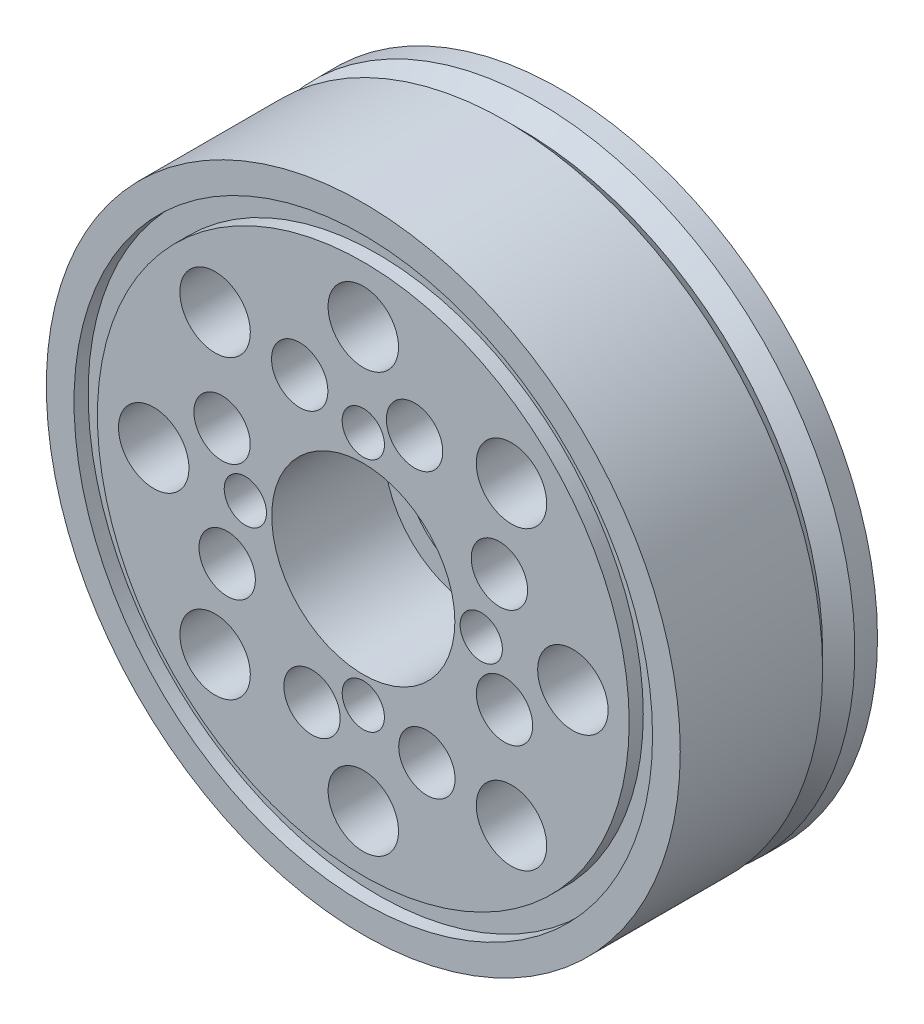
ISO-10303-21;
HEADER;
FILE_DESCRIPTION(('STEP AP214'),'2;1');
FILE_NAME('part.step','',(''),(''),'','','');
FILE_SCHEMA(('AUTOMOTIVE_DESIGN { 1 0 10303 214 1 1 1 1 }'));
ENDSEC;
DATA;
#1=APPLICATION_CONTEXT('core data for automotive mechanical design processes');
#2=APPLICATION_PROTOCOL_DEFINITION('international standard','automotive_design',2000,#1);
#3=PRODUCT_CONTEXT('',#1,'mechanical');
#4=PRODUCT('Part','Part','',(#3));
#5=PRODUCT_RELATED_PRODUCT_CATEGORY('part','',(#4));
#6=PRODUCT_DEFINITION_FORMATION('','',#4);
#7=PRODUCT_DEFINITION_CONTEXT('part definition',#1,'design');
#8=PRODUCT_DEFINITION('design','',#6,#7);
#9=PRODUCT_DEFINITION_SHAPE('','',#8);
#10=(LENGTH_UNIT() NAMED_UNIT(*) SI_UNIT(.MILLI.,.METRE.));
#11=(NAMED_UNIT(*) PLANE_ANGLE_UNIT() SI_UNIT($,.RADIAN.));
#12=(NAMED_UNIT(*) SI_UNIT($,.STERADIAN.) SOLID_ANGLE_UNIT());
#13=UNCERTAINTY_MEASURE_WITH_UNIT(LENGTH_MEASURE(1.E-05),#10,'distance_accuracy_value','');
#14=(GEOMETRIC_REPRESENTATION_CONTEXT(3) GLOBAL_UNCERTAINTY_ASSIGNED_CONTEXT((#13)) GLOBAL_UNIT_ASSIGNED_CONTEXT((#10,
#11,#12)) REPRESENTATION_CONTEXT('',''));
#15=CARTESIAN_POINT('',(0.,0.,0.));
#16=DIRECTION('',(0.,0.,1.));
#17=DIRECTION('',(1.,0.,0.));
#18=AXIS2_PLACEMENT_3D('',#15,#16,#17);
#19=CARTESIAN_POINT('',(0.,0.,15.827184369982));
#20=DIRECTION('',(0.,0.,-1.));
#21=DIRECTION('',(-1.,0.,0.));
#22=AXIS2_PLACEMENT_3D('',#19,#20,#21);
#23=CYLINDRICAL_SURFACE('',#22,27.999999);
#24=CARTESIAN_POINT('',(0.,0.,-1.59503723001799));
#25=DIRECTION('',(0.,0.,1.));
#26=DIRECTION('',(1.,0.,0.));
#27=AXIS2_PLACEMENT_3D('',#24,#25,#26);
#28=CIRCLE('',#27,27.999999);
#29=CARTESIAN_POINT('',(27.999999,0.,-1.59503723001799));
#30=VERTEX_POINT('',#29);
#31=EDGE_CURVE('E40',#30,#30,#28,.T.);
#32=ORIENTED_EDGE('',*,*,#31,.T.);
#33=EDGE_LOOP('',(#32));
#34=FACE_BOUND('',#33,.T.);
#35=CARTESIAN_POINT('',(0.,0.,0.404962769982008));
#36=DIRECTION('',(0.,0.,-1.));
#37=DIRECTION('',(-1.,0.,0.));
#38=AXIS2_PLACEMENT_3D('',#35,#36,#37);
#39=CIRCLE('',#38,27.999999);
#40=CARTESIAN_POINT('',(-27.999999,0.,0.404962769982008));
#41=VERTEX_POINT('',#40);
#42=EDGE_CURVE('E36',#41,#41,#39,.F.);
#43=ORIENTED_EDGE('',*,*,#42,.F.);
#44=EDGE_LOOP('',(#43));
#45=FACE_BOUND('',#44,.T.);
#46=ADVANCED_FACE('F33',(#34,#45),#23,.T.);
#47=CARTESIAN_POINT('',(0.,0.,15.827184369982));
#48=DIRECTION('',(0.,0.,1.));
#49=DIRECTION('',(1.,0.,0.));
#50=AXIS2_PLACEMENT_3D('',#47,#48,#49);
#51=CIRCLE('',#50,27.999999);
#52=CARTESIAN_POINT('',(27.999999,0.,15.827184369982));
#53=VERTEX_POINT('',#52);
#54=EDGE_CURVE('E10',#53,#53,#51,.T.);
#55=ORIENTED_EDGE('',*,*,#54,.F.);
#56=EDGE_LOOP('',(#55));
#57=FACE_BOUND('',#56,.T.);
#58=CARTESIAN_POINT('',(0.,0.,3.25183966621644));
#59=DIRECTION('',(0.,0.,1.));
#60=DIRECTION('',(1.,0.,0.));
#61=AXIS2_PLACEMENT_3D('',#58,#59,#60);
#62=CIRCLE('',#61,27.999999);
#63=CARTESIAN_POINT('',(27.999999,0.,3.25183966621644));
#64=VERTEX_POINT('',#63);
#65=EDGE_CURVE('E50',#64,#64,#62,.F.);
#66=ORIENTED_EDGE('',*,*,#65,.F.);
#67=EDGE_LOOP('',(#66));
#68=FACE_BOUND('',#67,.T.);
#69=ADVANCED_FACE('F209',(#57,#68),#23,.T.);
#70=CARTESIAN_POINT('',(0.,0.,15.827184369982));
#71=DIRECTION('',(0.,0.,1.));
#72=DIRECTION('',(1.,0.,0.));
#73=AXIS2_PLACEMENT_3D('',#70,#71,#72);
#74=PLANE('',#73);
#75=CARTESIAN_POINT('',(0.,0.,15.827184369982));
#76=DIRECTION('',(0.,0.,1.));
#77=DIRECTION('',(1.,0.,0.));
#78=AXIS2_PLACEMENT_3D('',#75,#76,#77);
#79=CIRCLE('',#78,25.5528630080935);
#80=CARTESIAN_POINT('',(25.5528630080935,0.,15.827184369982));
#81=VERTEX_POINT('',#80);
#82=EDGE_CURVE('E48',#81,#81,#79,.T.);
#83=ORIENTED_EDGE('',*,*,#82,.F.);
#84=EDGE_LOOP('',(#83));
#85=FACE_BOUND('',#84,.T.);
#86=ORIENTED_EDGE('',*,*,#54,.T.);
#87=EDGE_LOOP('',(#86));
#88=FACE_BOUND('',#87,.T.);
#89=ADVANCED_FACE('F206',(#85,#88),#74,.T.);
#90=CARTESIAN_POINT('',(0.,0.,-1.59503723001799));
#91=DIRECTION('',(0.,0.,1.));
#92=DIRECTION('',(1.,0.,0.));
#93=AXIS2_PLACEMENT_3D('',#90,#91,#92);
#94=PLANE('',#93);
#95=CARTESIAN_POINT('',(0.,0.,-1.59503723001799));
#96=DIRECTION('',(0.,0.,1.));
#97=DIRECTION('',(1.,0.,0.));
#98=AXIS2_PLACEMENT_3D('',#95,#96,#97);
#99=CIRCLE('',#98,6.222222);
#100=CARTESIAN_POINT('',(6.222222,0.,-1.59503723001799));
#101=VERTEX_POINT('',#100);
#102=EDGE_CURVE('E184',#101,#101,#99,.T.);
#103=ORIENTED_EDGE('',*,*,#102,.T.);
#104=EDGE_LOOP('',(#103));
#105=FACE_BOUND('',#104,.T.);
#106=ORIENTED_EDGE('',*,*,#31,.F.);
#107=EDGE_LOOP('',(#106));
#108=FACE_BOUND('',#107,.T.);
#109=ADVANCED_FACE('F208',(#105,#108),#94,.F.);
#110=CARTESIAN_POINT('',(0.,0.,14.582739969982));
#111=DIRECTION('',(0.,0.,1.));
#112=DIRECTION('',(1.,0.,0.));
#113=AXIS2_PLACEMENT_3D('',#110,#111,#112);
#114=CYLINDRICAL_SURFACE('',#113,25.5528630080935);
#115=CARTESIAN_POINT('',(0.,0.,14.582739969982));
#116=DIRECTION('',(0.,0.,1.));
#117=DIRECTION('',(1.,0.,0.));
#118=AXIS2_PLACEMENT_3D('',#115,#116,#117);
#119=CIRCLE('',#118,25.5528630080935);
#120=CARTESIAN_POINT('',(25.5528630080935,0.,14.582739969982));
#121=VERTEX_POINT('',#120);
#122=EDGE_CURVE('E45',#121,#121,#119,.T.);
#123=ORIENTED_EDGE('',*,*,#122,.F.);
#124=EDGE_LOOP('',(#123));
#125=FACE_BOUND('',#124,.T.);
#126=ORIENTED_EDGE('',*,*,#82,.T.);
#127=EDGE_LOOP('',(#126));
#128=FACE_BOUND('',#127,.T.);
#129=ADVANCED_FACE('F204',(#125,#128),#114,.F.);
#130=CARTESIAN_POINT('',(0.,0.,14.582739969982));
#131=DIRECTION('',(0.,0.,1.));
#132=DIRECTION('',(1.,0.,0.));
#133=AXIS2_PLACEMENT_3D('',#130,#131,#132);
#134=PLANE('',#133);
#135=CARTESIAN_POINT('',(0.,0.,14.582739969982));
#136=DIRECTION('',(0.,0.,1.));
#137=DIRECTION('',(1.,0.,0.));
#138=AXIS2_PLACEMENT_3D('',#135,#136,#137);
#139=CIRCLE('',#138,23.48741959096);
#140=CARTESIAN_POINT('',(23.48741959096,0.,14.582739969982));
#141=VERTEX_POINT('',#140);
#142=EDGE_CURVE('E194',#141,#141,#139,.T.);
#143=ORIENTED_EDGE('',*,*,#142,.F.);
#144=EDGE_LOOP('',(#143));
#145=FACE_BOUND('',#144,.T.);
#146=ORIENTED_EDGE('',*,*,#122,.T.);
#147=EDGE_LOOP('',(#146));
#148=FACE_BOUND('',#147,.T.);
#149=ADVANCED_FACE('F414',(#145,#148),#134,.T.);
#150=CARTESIAN_POINT('',(0.,0.,14.582739969982));
#151=DIRECTION('',(0.,0.,1.));
#152=DIRECTION('',(1.,0.,0.));
#153=AXIS2_PLACEMENT_3D('',#150,#151,#152);
#154=CYLINDRICAL_SURFACE('',#153,23.48741959096);
#155=ORIENTED_EDGE('',*,*,#142,.T.);
#156=EDGE_LOOP('',(#155));
#157=FACE_BOUND('',#156,.T.);
#158=CARTESIAN_POINT('',(0.,0.,15.827184369982));
#159=DIRECTION('',(0.,0.,1.));
#160=DIRECTION('',(1.,0.,0.));
#161=AXIS2_PLACEMENT_3D('',#158,#159,#160);
#162=CIRCLE('',#161,23.48741959096);
#163=CARTESIAN_POINT('',(23.48741959096,0.,15.827184369982));
#164=VERTEX_POINT('',#163);
#165=EDGE_CURVE('E191',#164,#164,#162,.T.);
#166=ORIENTED_EDGE('',*,*,#165,.F.);
#167=EDGE_LOOP('',(#166));
#168=FACE_BOUND('',#167,.T.);
#169=ADVANCED_FACE('F221',(#157,#168),#154,.T.);
#170=CARTESIAN_POINT('',(-12.4737591529476,4.53005844783731,15.827184369982));
#171=DIRECTION('',(0.,0.,1.));
#172=DIRECTION('',(0.707106781186556,0.707106781186539,0.));
#173=AXIS2_PLACEMENT_3D('',#170,#171,#172);
#174=CIRCLE('',#173,2.4888888);
#175=CARTESIAN_POINT('',(-10.7138490048483,6.28996859593654,15.827184369982));
#176=VERTEX_POINT('',#175);
#177=EDGE_CURVE('E56',#176,#176,#174,.T.);
#178=ORIENTED_EDGE('',*,*,#177,.F.);
#179=EDGE_LOOP('',(#178));
#180=FACE_BOUND('',#179,.T.);
#181=CARTESIAN_POINT('',(-12.0235147315742,-5.61704463629988,15.827184369982));
#182=DIRECTION('',(0.,0.,1.));
#183=DIRECTION('',(0.,1.,0.));
#184=AXIS2_PLACEMENT_3D('',#181,#182,#183);
#185=CIRCLE('',#184,2.4888888);
#186=CARTESIAN_POINT('',(-12.0235147315742,-3.12815583629987,15.827184369982));
#187=VERTEX_POINT('',#186);
#188=EDGE_CURVE('E67',#187,#187,#185,.T.);
#189=ORIENTED_EDGE('',*,*,#188,.F.);
#190=EDGE_LOOP('',(#189));
#191=FACE_BOUND('',#190,.T.);
#192=CARTESIAN_POINT('',(-4.53005844783726,-12.4737591529476,15.827184369982));
#193=DIRECTION('',(0.,0.,1.));
#194=DIRECTION('',(-0.707106781186541,0.707106781186554,0.));
#195=AXIS2_PLACEMENT_3D('',#192,#193,#194);
#196=CIRCLE('',#195,2.4888888);
#197=CARTESIAN_POINT('',(-6.2899685959365,-10.7138490048484,15.827184369982));
#198=VERTEX_POINT('',#197);
#199=EDGE_CURVE('E73',#198,#198,#196,.T.);
#200=ORIENTED_EDGE('',*,*,#199,.F.);
#201=EDGE_LOOP('',(#200));
#202=FACE_BOUND('',#201,.T.);
#203=CARTESIAN_POINT('',(5.6170446363,-12.0235147315741,15.827184369982));
#204=DIRECTION('',(0.,0.,1.));
#205=DIRECTION('',(-1.,0.,0.));
#206=AXIS2_PLACEMENT_3D('',#203,#204,#205);
#207=CIRCLE('',#206,2.4888888);
#208=CARTESIAN_POINT('',(3.1281558363,-12.0235147315741,15.827184369982));
#209=VERTEX_POINT('',#208);
#210=EDGE_CURVE('E79',#209,#209,#207,.T.);
#211=ORIENTED_EDGE('',*,*,#210,.F.);
#212=EDGE_LOOP('',(#211));
#213=FACE_BOUND('',#212,.T.);
#214=CARTESIAN_POINT('',(12.4737591529476,-4.53005844783722,15.827184369982));
#215=DIRECTION('',(0.,0.,1.));
#216=DIRECTION('',(-0.707106781186551,-0.707106781186544,0.));
#217=AXIS2_PLACEMENT_3D('',#214,#215,#216);
#218=CIRCLE('',#217,2.4888888);
#219=CARTESIAN_POINT('',(10.7138490048484,-6.28996859593646,15.827184369982));
#220=VERTEX_POINT('',#219);
#221=EDGE_CURVE('E85',#220,#220,#218,.T.);
#222=ORIENTED_EDGE('',*,*,#221,.F.);
#223=EDGE_LOOP('',(#222));
#224=FACE_BOUND('',#223,.T.);
#225=CARTESIAN_POINT('',(12.0235147315741,5.61704463629996,15.827184369982));
#226=DIRECTION('',(0.,0.,1.));
#227=DIRECTION('',(0.,-1.,0.));
#228=AXIS2_PLACEMENT_3D('',#225,#226,#227);
#229=CIRCLE('',#228,2.4888888);
#230=CARTESIAN_POINT('',(12.0235147315741,3.12815583629996,15.827184369982));
#231=VERTEX_POINT('',#230);
#232=EDGE_CURVE('E91',#231,#231,#229,.T.);
#233=ORIENTED_EDGE('',*,*,#232,.F.);
#234=EDGE_LOOP('',(#233));
#235=FACE_BOUND('',#234,.T.);
#236=CARTESIAN_POINT('',(4.53005844783718,12.4737591529477,15.827184369982));
#237=DIRECTION('',(0.,0.,1.));
#238=DIRECTION('',(0.707106781186546,-0.707106781186549,0.));
#239=AXIS2_PLACEMENT_3D('',#236,#237,#238);
#240=CIRCLE('',#239,2.4888888);
#241=CARTESIAN_POINT('',(6.28996859593642,10.7138490048484,15.827184369982));
#242=VERTEX_POINT('',#241);
#243=EDGE_CURVE('E97',#242,#242,#240,.T.);
#244=ORIENTED_EDGE('',*,*,#243,.F.);
#245=EDGE_LOOP('',(#244));
#246=FACE_BOUND('',#245,.T.);
#247=CARTESIAN_POINT('',(-5.6170446363,12.0235147315741,15.827184369982));
#248=DIRECTION('',(0.,0.,1.));
#249=DIRECTION('',(1.,0.,0.));
#250=AXIS2_PLACEMENT_3D('',#247,#248,#249);
#251=CIRCLE('',#250,2.4888888);
#252=CARTESIAN_POINT('',(-3.1281558363,12.0235147315741,15.827184369982));
#253=VERTEX_POINT('',#252);
#254=EDGE_CURVE('E103',#253,#253,#251,.T.);
#255=ORIENTED_EDGE('',*,*,#254,.F.);
#256=EDGE_LOOP('',(#255));
#257=FACE_BOUND('',#256,.T.);
#258=CARTESIAN_POINT('',(-13.0906483291239,13.0906483291242,15.827184369982));
#259=DIRECTION('',(0.,0.,1.));
#260=DIRECTION('',(0.707106781186556,0.707106781186539,0.));
#261=AXIS2_PLACEMENT_3D('',#258,#259,#260);
#262=CIRCLE('',#261,3.111111);
#263=CARTESIAN_POINT('',(-10.8907606439998,15.2905360142482,15.827184369982));
#264=VERTEX_POINT('',#263);
#265=EDGE_CURVE('E107',#264,#264,#262,.T.);
#266=ORIENTED_EDGE('',*,*,#265,.F.);
#267=EDGE_LOOP('',(#266));
#268=FACE_BOUND('',#267,.T.);
#269=CARTESIAN_POINT('',(-18.5129724073039,1.94376956044558E-13,15.827184369982));
#270=DIRECTION('',(0.,0.,1.));
#271=DIRECTION('',(0.,1.,0.));
#272=AXIS2_PLACEMENT_3D('',#269,#270,#271);
#273=CIRCLE('',#272,3.111111);
#274=CARTESIAN_POINT('',(-18.5129724073039,3.11111100000019,15.827184369982));
#275=VERTEX_POINT('',#274);
#276=EDGE_CURVE('E115',#275,#275,#273,.T.);
#277=ORIENTED_EDGE('',*,*,#276,.F.);
#278=EDGE_LOOP('',(#277));
#279=FACE_BOUND('',#278,.T.);
#280=CARTESIAN_POINT('',(-13.0906483291241,-13.0906483291239,15.827184369982));
#281=DIRECTION('',(0.,0.,1.));
#282=DIRECTION('',(-0.707106781186541,0.707106781186554,0.));
#283=AXIS2_PLACEMENT_3D('',#280,#281,#282);
#284=CIRCLE('',#283,3.111111);
#285=CARTESIAN_POINT('',(-15.2905360142482,-10.8907606439998,15.827184369982));
#286=VERTEX_POINT('',#285);
#287=EDGE_CURVE('E121',#286,#286,#284,.T.);
#288=ORIENTED_EDGE('',*,*,#287,.F.);
#289=EDGE_LOOP('',(#288));
#290=FACE_BOUND('',#289,.T.);
#291=CARTESIAN_POINT('',(0.,-18.5129724073039,15.827184369982));
#292=DIRECTION('',(0.,0.,1.));
#293=DIRECTION('',(-1.,0.,0.));
#294=AXIS2_PLACEMENT_3D('',#291,#292,#293);
#295=CIRCLE('',#294,3.111111);
#296=CARTESIAN_POINT('',(-3.111111,-18.5129724073039,15.827184369982));
#297=VERTEX_POINT('',#296);
#298=EDGE_CURVE('E127',#297,#297,#295,.T.);
#299=ORIENTED_EDGE('',*,*,#298,.F.);
#300=EDGE_LOOP('',(#299));
#301=FACE_BOUND('',#300,.T.);
#302=CARTESIAN_POINT('',(13.090648329124,-13.0906483291241,15.827184369982));
#303=DIRECTION('',(0.,0.,1.));
#304=DIRECTION('',(-0.707106781186551,-0.707106781186544,0.));
#305=AXIS2_PLACEMENT_3D('',#302,#303,#304);
#306=CIRCLE('',#305,3.111111);
#307=CARTESIAN_POINT('',(10.8907606439999,-15.2905360142481,15.827184369982));
#308=VERTEX_POINT('',#307);
#309=EDGE_CURVE('E133',#308,#308,#306,.T.);
#310=ORIENTED_EDGE('',*,*,#309,.F.);
#311=EDGE_LOOP('',(#310));
#312=FACE_BOUND('',#311,.T.);
#313=CARTESIAN_POINT('',(18.5129724073039,0.,15.827184369982));
#314=DIRECTION('',(0.,0.,1.));
#315=DIRECTION('',(0.,-1.,0.));
#316=AXIS2_PLACEMENT_3D('',#313,#314,#315);
#317=CIRCLE('',#316,3.111111);
#318=CARTESIAN_POINT('',(18.5129724073039,-3.11111100000006,15.827184369982));
#319=VERTEX_POINT('',#318);
#320=EDGE_CURVE('E139',#319,#319,#317,.T.);
#321=ORIENTED_EDGE('',*,*,#320,.F.);
#322=EDGE_LOOP('',(#321));
#323=FACE_BOUND('',#322,.T.);
#324=CARTESIAN_POINT('',(13.090648329124,13.090648329124,15.827184369982));
#325=DIRECTION('',(0.,0.,1.));
#326=DIRECTION('',(0.707106781186546,-0.707106781186549,0.));
#327=AXIS2_PLACEMENT_3D('',#324,#325,#326);
#328=CIRCLE('',#327,3.111111);
#329=CARTESIAN_POINT('',(15.2905360142481,10.8907606439999,15.827184369982));
#330=VERTEX_POINT('',#329);
#331=EDGE_CURVE('E145',#330,#330,#328,.T.);
#332=ORIENTED_EDGE('',*,*,#331,.F.);
#333=EDGE_LOOP('',(#332));
#334=FACE_BOUND('',#333,.T.);
#335=CARTESIAN_POINT('',(0.,18.5129724073039,15.827184369982));
#336=DIRECTION('',(0.,0.,1.));
#337=DIRECTION('',(1.,0.,0.));
#338=AXIS2_PLACEMENT_3D('',#335,#336,#337);
#339=CIRCLE('',#338,3.111111);
#340=CARTESIAN_POINT('',(3.111111,18.5129724073039,15.827184369982));
#341=VERTEX_POINT('',#340);
#342=EDGE_CURVE('E151',#341,#341,#339,.T.);
#343=ORIENTED_EDGE('',*,*,#342,.F.);
#344=EDGE_LOOP('',(#343));
#345=FACE_BOUND('',#344,.T.);
#346=CARTESIAN_POINT('',(-10.4194886355998,1.09602213379154E-13,15.827184369982));
#347=DIRECTION('',(0.,0.,1.));
#348=DIRECTION('',(0.,1.,0.));
#349=AXIS2_PLACEMENT_3D('',#346,#347,#348);
#350=CIRCLE('',#349,1.8666666);
#351=CARTESIAN_POINT('',(-10.4194886355997,1.86666660000011,15.827184369982));
#352=VERTEX_POINT('',#351);
#353=EDGE_CURVE('E155',#352,#352,#350,.T.);
#354=ORIENTED_EDGE('',*,*,#353,.F.);
#355=EDGE_LOOP('',(#354));
#356=FACE_BOUND('',#355,.T.);
#357=CARTESIAN_POINT('',(0.,-10.4194886355998,15.827184369982));
#358=DIRECTION('',(0.,0.,1.));
#359=DIRECTION('',(-1.,0.,0.));
#360=AXIS2_PLACEMENT_3D('',#357,#358,#359);
#361=CIRCLE('',#360,1.8666666);
#362=CARTESIAN_POINT('',(-1.8666666,-10.4194886355998,15.827184369982));
#363=VERTEX_POINT('',#362);
#364=EDGE_CURVE('E163',#363,#363,#361,.T.);
#365=ORIENTED_EDGE('',*,*,#364,.F.);
#366=EDGE_LOOP('',(#365));
#367=FACE_BOUND('',#366,.T.);
#368=CARTESIAN_POINT('',(10.4194886355998,0.,15.827184369982));
#369=DIRECTION('',(0.,0.,1.));
#370=DIRECTION('',(0.,-1.,0.));
#371=AXIS2_PLACEMENT_3D('',#368,#369,#370);
#372=CIRCLE('',#371,1.8666666);
#373=CARTESIAN_POINT('',(10.4194886355997,-1.86666660000004,15.827184369982));
#374=VERTEX_POINT('',#373);
#375=EDGE_CURVE('E169',#374,#374,#372,.T.);
#376=ORIENTED_EDGE('',*,*,#375,.F.);
#377=EDGE_LOOP('',(#376));
#378=FACE_BOUND('',#377,.T.);
#379=CARTESIAN_POINT('',(0.,10.4194886355998,15.827184369982));
#380=DIRECTION('',(0.,0.,1.));
#381=DIRECTION('',(1.,0.,0.));
#382=AXIS2_PLACEMENT_3D('',#379,#380,#381);
#383=CIRCLE('',#382,1.8666666);
#384=CARTESIAN_POINT('',(1.8666666,10.4194886355998,15.827184369982));
#385=VERTEX_POINT('',#384);
#386=EDGE_CURVE('E175',#385,#385,#383,.T.);
#387=ORIENTED_EDGE('',*,*,#386,.F.);
#388=EDGE_LOOP('',(#387));
#389=FACE_BOUND('',#388,.T.);
#390=CARTESIAN_POINT('',(0.,0.,15.827184369982));
#391=DIRECTION('',(0.,0.,1.));
#392=DIRECTION('',(1.,0.,0.));
#393=AXIS2_PLACEMENT_3D('',#390,#391,#392);
#394=CIRCLE('',#393,8.0888886);
#395=CARTESIAN_POINT('',(8.0888886,0.,15.827184369982));
#396=VERTEX_POINT('',#395);
#397=EDGE_CURVE('E187',#396,#396,#394,.T.);
#398=ORIENTED_EDGE('',*,*,#397,.F.);
#399=EDGE_LOOP('',(#398));
#400=FACE_BOUND('',#399,.T.);
#401=ORIENTED_EDGE('',*,*,#165,.T.);
#402=EDGE_LOOP('',(#401));
#403=FACE_BOUND('',#402,.T.);
#404=ADVANCED_FACE('F211',(#180,#191,#202,#213,#224,#235,#246,#257,#268,#279,#290,#301,#312,
#323,#334,#345,#356,#367,#378,#389,#400,#403),#74,.T.);
#405=CARTESIAN_POINT('',(0.,0.,5.87162916998201));
#406=DIRECTION('',(0.,0.,1.));
#407=DIRECTION('',(1.,0.,0.));
#408=AXIS2_PLACEMENT_3D('',#405,#406,#407);
#409=CYLINDRICAL_SURFACE('',#408,8.0888886);
#410=CARTESIAN_POINT('',(0.,0.,5.87162916998201));
#411=DIRECTION('',(0.,0.,1.));
#412=DIRECTION('',(1.,0.,0.));
#413=AXIS2_PLACEMENT_3D('',#410,#411,#412);
#414=CIRCLE('',#413,8.0888886);
#415=CARTESIAN_POINT('',(8.0888886,0.,5.87162916998201));
#416=VERTEX_POINT('',#415);
#417=EDGE_CURVE('E188',#416,#416,#414,.T.);
#418=ORIENTED_EDGE('',*,*,#417,.F.);
#419=EDGE_LOOP('',(#418));
#420=FACE_BOUND('',#419,.T.);
#421=ORIENTED_EDGE('',*,*,#397,.T.);
#422=EDGE_LOOP('',(#421));
#423=FACE_BOUND('',#422,.T.);
#424=ADVANCED_FACE('F220',(#420,#423),#409,.F.);
#425=CARTESIAN_POINT('',(0.,0.,5.87162916998201));
#426=DIRECTION('',(0.,0.,1.));
#427=DIRECTION('',(1.,0.,0.));
#428=AXIS2_PLACEMENT_3D('',#425,#426,#427);
#429=PLANE('',#428);
#430=CARTESIAN_POINT('',(0.,0.,5.87162916998201));
#431=DIRECTION('',(0.,0.,1.));
#432=DIRECTION('',(1.,0.,0.));
#433=AXIS2_PLACEMENT_3D('',#430,#431,#432);
#434=CIRCLE('',#433,6.222222);
#435=CARTESIAN_POINT('',(6.222222,0.,5.87162916998201));
#436=VERTEX_POINT('',#435);
#437=EDGE_CURVE('E179',#436,#436,#434,.T.);
#438=ORIENTED_EDGE('',*,*,#437,.F.);
#439=EDGE_LOOP('',(#438));
#440=FACE_BOUND('',#439,.T.);
#441=ORIENTED_EDGE('',*,*,#417,.T.);
#442=EDGE_LOOP('',(#441));
#443=FACE_BOUND('',#442,.T.);
#444=ADVANCED_FACE('F404',(#440,#443),#429,.T.);
#445=CARTESIAN_POINT('',(0.,0.,-4.08392603001799));
#446=DIRECTION('',(0.,0.,1.));
#447=DIRECTION('',(1.,0.,0.));
#448=AXIS2_PLACEMENT_3D('',#445,#446,#447);
#449=CYLINDRICAL_SURFACE('',#448,6.222222);
#450=ORIENTED_EDGE('',*,*,#437,.T.);
#451=EDGE_LOOP('',(#450));
#452=FACE_BOUND('',#451,.T.);
#453=ORIENTED_EDGE('',*,*,#102,.F.);
#454=EDGE_LOOP('',(#453));
#455=FACE_BOUND('',#454,.T.);
#456=ADVANCED_FACE('F400',(#452,#455),#449,.F.);
#457=CARTESIAN_POINT('',(0.,10.4194886355998,9.60496236998201));
#458=DIRECTION('',(0.,0.,1.));
#459=DIRECTION('',(1.,0.,0.));
#460=AXIS2_PLACEMENT_3D('',#457,#458,#459);
#461=CYLINDRICAL_SURFACE('',#460,1.8666666);
#462=CARTESIAN_POINT('',(0.,10.4194886355998,9.60496236998201));
#463=DIRECTION('',(0.,0.,1.));
#464=DIRECTION('',(1.,0.,0.));
#465=AXIS2_PLACEMENT_3D('',#462,#463,#464);
#466=CIRCLE('',#465,1.8666666);
#467=CARTESIAN_POINT('',(1.8666666,10.4194886355998,9.60496236998201));
#468=VERTEX_POINT('',#467);
#469=EDGE_CURVE('E176',#468,#468,#466,.T.);
#470=ORIENTED_EDGE('',*,*,#469,.F.);
#471=EDGE_LOOP('',(#470));
#472=FACE_BOUND('',#471,.T.);
#473=ORIENTED_EDGE('',*,*,#386,.T.);
#474=EDGE_LOOP('',(#473));
#475=FACE_BOUND('',#474,.T.);
#476=ADVANCED_FACE('F396',(#472,#475),#461,.F.);
#477=CARTESIAN_POINT('',(0.,10.4194886355998,9.60496236998201));
#478=DIRECTION('',(0.,0.,1.));
#479=DIRECTION('',(1.,0.,0.));
#480=AXIS2_PLACEMENT_3D('',#477,#478,#479);
#481=PLANE('',#480);
#482=ORIENTED_EDGE('',*,*,#469,.T.);
#483=EDGE_LOOP('',(#482));
#484=FACE_BOUND('',#483,.T.);
#485=ADVANCED_FACE('F392',(#484),#481,.T.);
#486=CARTESIAN_POINT('',(10.4194886355998,0.,9.60496236998201));
#487=DIRECTION('',(0.,0.,1.));
#488=DIRECTION('',(0.,-1.,0.));
#489=AXIS2_PLACEMENT_3D('',#486,#487,#488);
#490=CYLINDRICAL_SURFACE('',#489,1.8666666);
#491=CARTESIAN_POINT('',(10.4194886355998,0.,9.60496236998201));
#492=DIRECTION('',(0.,0.,1.));
#493=DIRECTION('',(0.,-1.,0.));
#494=AXIS2_PLACEMENT_3D('',#491,#492,#493);
#495=CIRCLE('',#494,1.8666666);
#496=CARTESIAN_POINT('',(10.4194886355997,-1.86666660000004,9.60496236998201));
#497=VERTEX_POINT('',#496);
#498=EDGE_CURVE('E172',#497,#497,#495,.T.);
#499=ORIENTED_EDGE('',*,*,#498,.F.);
#500=EDGE_LOOP('',(#499));
#501=FACE_BOUND('',#500,.T.);
#502=ORIENTED_EDGE('',*,*,#375,.T.);
#503=EDGE_LOOP('',(#502));
#504=FACE_BOUND('',#503,.T.);
#505=ADVANCED_FACE('F388',(#501,#504),#490,.F.);
#506=CARTESIAN_POINT('',(10.4194886355998,0.,9.60496236998201));
#507=DIRECTION('',(0.,0.,1.));
#508=DIRECTION('',(0.,-1.,0.));
#509=AXIS2_PLACEMENT_3D('',#506,#507,#508);
#510=PLANE('',#509);
#511=ORIENTED_EDGE('',*,*,#498,.T.);
#512=EDGE_LOOP('',(#511));
#513=FACE_BOUND('',#512,.T.);
#514=ADVANCED_FACE('F384',(#513),#510,.T.);
#515=CARTESIAN_POINT('',(0.,-10.4194886355998,9.60496236998201));
#516=DIRECTION('',(0.,0.,1.));
#517=DIRECTION('',(-1.,0.,0.));
#518=AXIS2_PLACEMENT_3D('',#515,#516,#517);
#519=CYLINDRICAL_SURFACE('',#518,1.8666666);
#520=CARTESIAN_POINT('',(0.,-10.4194886355998,9.60496236998201));
#521=DIRECTION('',(0.,0.,1.));
#522=DIRECTION('',(-1.,0.,0.));
#523=AXIS2_PLACEMENT_3D('',#520,#521,#522);
#524=CIRCLE('',#523,1.8666666);
#525=CARTESIAN_POINT('',(-1.8666666,-10.4194886355998,9.60496236998201));
#526=VERTEX_POINT('',#525);
#527=EDGE_CURVE('E166',#526,#526,#524,.T.);
#528=ORIENTED_EDGE('',*,*,#527,.F.);
#529=EDGE_LOOP('',(#528));
#530=FACE_BOUND('',#529,.T.);
#531=ORIENTED_EDGE('',*,*,#364,.T.);
#532=EDGE_LOOP('',(#531));
#533=FACE_BOUND('',#532,.T.);
#534=ADVANCED_FACE('F380',(#530,#533),#519,.F.);
#535=CARTESIAN_POINT('',(0.,-10.4194886355998,9.60496236998201));
#536=DIRECTION('',(0.,0.,1.));
#537=DIRECTION('',(-1.,0.,0.));
#538=AXIS2_PLACEMENT_3D('',#535,#536,#537);
#539=PLANE('',#538);
#540=ORIENTED_EDGE('',*,*,#527,.T.);
#541=EDGE_LOOP('',(#540));
#542=FACE_BOUND('',#541,.T.);
#543=ADVANCED_FACE('F376',(#542),#539,.T.);
#544=CARTESIAN_POINT('',(-10.4194886355998,1.09602213379154E-13,9.60496236998201));
#545=DIRECTION('',(0.,0.,1.));
#546=DIRECTION('',(0.,1.,0.));
#547=AXIS2_PLACEMENT_3D('',#544,#545,#546);
#548=CYLINDRICAL_SURFACE('',#547,1.8666666);
#549=CARTESIAN_POINT('',(-10.4194886355998,1.09602213379154E-13,9.60496236998201));
#550=DIRECTION('',(0.,0.,1.));
#551=DIRECTION('',(0.,1.,0.));
#552=AXIS2_PLACEMENT_3D('',#549,#550,#551);
#553=CIRCLE('',#552,1.8666666);
#554=CARTESIAN_POINT('',(-10.4194886355997,1.86666660000011,9.60496236998201));
#555=VERTEX_POINT('',#554);
#556=EDGE_CURVE('E160',#555,#555,#553,.T.);
#557=ORIENTED_EDGE('',*,*,#556,.F.);
#558=EDGE_LOOP('',(#557));
#559=FACE_BOUND('',#558,.T.);
#560=ORIENTED_EDGE('',*,*,#353,.T.);
#561=EDGE_LOOP('',(#560));
#562=FACE_BOUND('',#561,.T.);
#563=ADVANCED_FACE('F372',(#559,#562),#548,.F.);
#564=CARTESIAN_POINT('',(-10.4194886355998,1.09602213379154E-13,9.60496236998201));
#565=DIRECTION('',(0.,0.,1.));
#566=DIRECTION('',(0.,1.,0.));
#567=AXIS2_PLACEMENT_3D('',#564,#565,#566);
#568=PLANE('',#567);
#569=ORIENTED_EDGE('',*,*,#556,.T.);
#570=EDGE_LOOP('',(#569));
#571=FACE_BOUND('',#570,.T.);
#572=ADVANCED_FACE('F368',(#571),#568,.T.);
#573=CARTESIAN_POINT('',(0.,18.5129724073039,9.60496236998201));
#574=DIRECTION('',(0.,0.,1.));
#575=DIRECTION('',(1.,0.,0.));
#576=AXIS2_PLACEMENT_3D('',#573,#574,#575);
#577=CYLINDRICAL_SURFACE('',#576,3.111111);
#578=CARTESIAN_POINT('',(0.,18.5129724073039,9.60496236998201));
#579=DIRECTION('',(0.,0.,1.));
#580=DIRECTION('',(1.,0.,0.));
#581=AXIS2_PLACEMENT_3D('',#578,#579,#580);
#582=CIRCLE('',#581,3.111111);
#583=CARTESIAN_POINT('',(3.111111,18.5129724073039,9.60496236998201));
#584=VERTEX_POINT('',#583);
#585=EDGE_CURVE('E152',#584,#584,#582,.T.);
#586=ORIENTED_EDGE('',*,*,#585,.F.);
#587=EDGE_LOOP('',(#586));
#588=FACE_BOUND('',#587,.T.);
#589=ORIENTED_EDGE('',*,*,#342,.T.);
#590=EDGE_LOOP('',(#589));
#591=FACE_BOUND('',#590,.T.);
#592=ADVANCED_FACE('F364',(#588,#591),#577,.F.);
#593=CARTESIAN_POINT('',(0.,18.5129724073039,9.60496236998201));
#594=DIRECTION('',(0.,0.,1.));
#595=DIRECTION('',(1.,0.,0.));
#596=AXIS2_PLACEMENT_3D('',#593,#594,#595);
#597=PLANE('',#596);
#598=ORIENTED_EDGE('',*,*,#585,.T.);
#599=EDGE_LOOP('',(#598));
#600=FACE_BOUND('',#599,.T.);
#601=ADVANCED_FACE('F360',(#600),#597,.T.);
#602=CARTESIAN_POINT('',(13.090648329124,13.090648329124,9.60496236998201));
#603=DIRECTION('',(0.,0.,1.));
#604=DIRECTION('',(0.707106781186546,-0.707106781186549,0.));
#605=AXIS2_PLACEMENT_3D('',#602,#603,#604);
#606=CYLINDRICAL_SURFACE('',#605,3.111111);
#607=CARTESIAN_POINT('',(13.090648329124,13.090648329124,9.60496236998201));
#608=DIRECTION('',(0.,0.,1.));
#609=DIRECTION('',(0.707106781186546,-0.707106781186549,0.));
#610=AXIS2_PLACEMENT_3D('',#607,#608,#609);
#611=CIRCLE('',#610,3.111111);
#612=CARTESIAN_POINT('',(15.2905360142481,10.8907606439999,9.60496236998201));
#613=VERTEX_POINT('',#612);
#614=EDGE_CURVE('E148',#613,#613,#611,.T.);
#615=ORIENTED_EDGE('',*,*,#614,.F.);
#616=EDGE_LOOP('',(#615));
#617=FACE_BOUND('',#616,.T.);
#618=ORIENTED_EDGE('',*,*,#331,.T.);
#619=EDGE_LOOP('',(#618));
#620=FACE_BOUND('',#619,.T.);
#621=ADVANCED_FACE('F356',(#617,#620),#606,.F.);
#622=CARTESIAN_POINT('',(13.090648329124,13.090648329124,9.60496236998201));
#623=DIRECTION('',(0.,0.,1.));
#624=DIRECTION('',(0.707106781186546,-0.707106781186549,0.));
#625=AXIS2_PLACEMENT_3D('',#622,#623,#624);
#626=PLANE('',#625);
#627=ORIENTED_EDGE('',*,*,#614,.T.);
#628=EDGE_LOOP('',(#627));
#629=FACE_BOUND('',#628,.T.);
#630=ADVANCED_FACE('F352',(#629),#626,.T.);
#631=CARTESIAN_POINT('',(18.5129724073039,0.,9.60496236998201));
#632=DIRECTION('',(0.,0.,1.));
#633=DIRECTION('',(0.,-1.,0.));
#634=AXIS2_PLACEMENT_3D('',#631,#632,#633);
#635=CYLINDRICAL_SURFACE('',#634,3.111111);
#636=CARTESIAN_POINT('',(18.5129724073039,0.,9.60496236998201));
#637=DIRECTION('',(0.,0.,1.));
#638=DIRECTION('',(0.,-1.,0.));
#639=AXIS2_PLACEMENT_3D('',#636,#637,#638);
#640=CIRCLE('',#639,3.111111);
#641=CARTESIAN_POINT('',(18.5129724073039,-3.11111100000006,9.60496236998201));
#642=VERTEX_POINT('',#641);
#643=EDGE_CURVE('E142',#642,#642,#640,.T.);
#644=ORIENTED_EDGE('',*,*,#643,.F.);
#645=EDGE_LOOP('',(#644));
#646=FACE_BOUND('',#645,.T.);
#647=ORIENTED_EDGE('',*,*,#320,.T.);
#648=EDGE_LOOP('',(#647));
#649=FACE_BOUND('',#648,.T.);
#650=ADVANCED_FACE('F348',(#646,#649),#635,.F.);
#651=CARTESIAN_POINT('',(18.5129724073039,0.,9.60496236998201));
#652=DIRECTION('',(0.,0.,1.));
#653=DIRECTION('',(0.,-1.,0.));
#654=AXIS2_PLACEMENT_3D('',#651,#652,#653);
#655=PLANE('',#654);
#656=ORIENTED_EDGE('',*,*,#643,.T.);
#657=EDGE_LOOP('',(#656));
#658=FACE_BOUND('',#657,.T.);
#659=ADVANCED_FACE('F344',(#658),#655,.T.);
#660=CARTESIAN_POINT('',(13.090648329124,-13.0906483291241,9.60496236998201));
#661=DIRECTION('',(0.,0.,1.));
#662=DIRECTION('',(-0.707106781186551,-0.707106781186544,0.));
#663=AXIS2_PLACEMENT_3D('',#660,#661,#662);
#664=CYLINDRICAL_SURFACE('',#663,3.111111);
#665=CARTESIAN_POINT('',(13.090648329124,-13.0906483291241,9.60496236998201));
#666=DIRECTION('',(0.,0.,1.));
#667=DIRECTION('',(-0.707106781186551,-0.707106781186544,0.));
#668=AXIS2_PLACEMENT_3D('',#665,#666,#667);
#669=CIRCLE('',#668,3.111111);
#670=CARTESIAN_POINT('',(10.8907606439999,-15.2905360142481,9.60496236998201));
#671=VERTEX_POINT('',#670);
#672=EDGE_CURVE('E136',#671,#671,#669,.T.);
#673=ORIENTED_EDGE('',*,*,#672,.F.);
#674=EDGE_LOOP('',(#673));
#675=FACE_BOUND('',#674,.T.);
#676=ORIENTED_EDGE('',*,*,#309,.T.);
#677=EDGE_LOOP('',(#676));
#678=FACE_BOUND('',#677,.T.);
#679=ADVANCED_FACE('F340',(#675,#678),#664,.F.);
#680=CARTESIAN_POINT('',(13.090648329124,-13.0906483291241,9.60496236998201));
#681=DIRECTION('',(0.,0.,1.));
#682=DIRECTION('',(-0.707106781186551,-0.707106781186544,0.));
#683=AXIS2_PLACEMENT_3D('',#680,#681,#682);
#684=PLANE('',#683);
#685=ORIENTED_EDGE('',*,*,#672,.T.);
#686=EDGE_LOOP('',(#685));
#687=FACE_BOUND('',#686,.T.);
#688=ADVANCED_FACE('F336',(#687),#684,.T.);
#689=CARTESIAN_POINT('',(0.,-18.5129724073039,9.60496236998201));
#690=DIRECTION('',(0.,0.,1.));
#691=DIRECTION('',(-1.,0.,0.));
#692=AXIS2_PLACEMENT_3D('',#689,#690,#691);
#693=CYLINDRICAL_SURFACE('',#692,3.111111);
#694=CARTESIAN_POINT('',(0.,-18.5129724073039,9.60496236998201));
#695=DIRECTION('',(0.,0.,1.));
#696=DIRECTION('',(-1.,0.,0.));
#697=AXIS2_PLACEMENT_3D('',#694,#695,#696);
#698=CIRCLE('',#697,3.111111);
#699=CARTESIAN_POINT('',(-3.111111,-18.5129724073039,9.60496236998201));
#700=VERTEX_POINT('',#699);
#701=EDGE_CURVE('E130',#700,#700,#698,.T.);
#702=ORIENTED_EDGE('',*,*,#701,.F.);
#703=EDGE_LOOP('',(#702));
#704=FACE_BOUND('',#703,.T.);
#705=ORIENTED_EDGE('',*,*,#298,.T.);
#706=EDGE_LOOP('',(#705));
#707=FACE_BOUND('',#706,.T.);
#708=ADVANCED_FACE('F332',(#704,#707),#693,.F.);
#709=CARTESIAN_POINT('',(0.,-18.5129724073039,9.60496236998201));
#710=DIRECTION('',(0.,0.,1.));
#711=DIRECTION('',(-1.,0.,0.));
#712=AXIS2_PLACEMENT_3D('',#709,#710,#711);
#713=PLANE('',#712);
#714=ORIENTED_EDGE('',*,*,#701,.T.);
#715=EDGE_LOOP('',(#714));
#716=FACE_BOUND('',#715,.T.);
#717=ADVANCED_FACE('F328',(#716),#713,.T.);
#718=CARTESIAN_POINT('',(-13.0906483291241,-13.0906483291239,9.60496236998201));
#719=DIRECTION('',(0.,0.,1.));
#720=DIRECTION('',(-0.707106781186541,0.707106781186554,0.));
#721=AXIS2_PLACEMENT_3D('',#718,#719,#720);
#722=CYLINDRICAL_SURFACE('',#721,3.111111);
#723=CARTESIAN_POINT('',(-13.0906483291241,-13.0906483291239,9.60496236998201));
#724=DIRECTION('',(0.,0.,1.));
#725=DIRECTION('',(-0.707106781186541,0.707106781186554,0.));
#726=AXIS2_PLACEMENT_3D('',#723,#724,#725);
#727=CIRCLE('',#726,3.111111);
#728=CARTESIAN_POINT('',(-15.2905360142482,-10.8907606439998,9.60496236998201));
#729=VERTEX_POINT('',#728);
#730=EDGE_CURVE('E124',#729,#729,#727,.T.);
#731=ORIENTED_EDGE('',*,*,#730,.F.);
#732=EDGE_LOOP('',(#731));
#733=FACE_BOUND('',#732,.T.);
#734=ORIENTED_EDGE('',*,*,#287,.T.);
#735=EDGE_LOOP('',(#734));
#736=FACE_BOUND('',#735,.T.);
#737=ADVANCED_FACE('F324',(#733,#736),#722,.F.);
#738=CARTESIAN_POINT('',(-13.0906483291241,-13.0906483291239,9.60496236998201));
#739=DIRECTION('',(0.,0.,1.));
#740=DIRECTION('',(-0.707106781186541,0.707106781186554,0.));
#741=AXIS2_PLACEMENT_3D('',#738,#739,#740);
#742=PLANE('',#741);
#743=ORIENTED_EDGE('',*,*,#730,.T.);
#744=EDGE_LOOP('',(#743));
#745=FACE_BOUND('',#744,.T.);
#746=ADVANCED_FACE('F320',(#745),#742,.T.);
#747=CARTESIAN_POINT('',(-18.5129724073039,1.94376956044558E-13,9.60496236998201));
#748=DIRECTION('',(0.,0.,1.));
#749=DIRECTION('',(0.,1.,0.));
#750=AXIS2_PLACEMENT_3D('',#747,#748,#749);
#751=CYLINDRICAL_SURFACE('',#750,3.111111);
#752=CARTESIAN_POINT('',(-18.5129724073039,1.94376956044558E-13,9.60496236998201));
#753=DIRECTION('',(0.,0.,1.));
#754=DIRECTION('',(0.,1.,0.));
#755=AXIS2_PLACEMENT_3D('',#752,#753,#754);
#756=CIRCLE('',#755,3.111111);
#757=CARTESIAN_POINT('',(-18.5129724073039,3.11111100000019,9.60496236998201));
#758=VERTEX_POINT('',#757);
#759=EDGE_CURVE('E118',#758,#758,#756,.T.);
#760=ORIENTED_EDGE('',*,*,#759,.F.);
#761=EDGE_LOOP('',(#760));
#762=FACE_BOUND('',#761,.T.);
#763=ORIENTED_EDGE('',*,*,#276,.T.);
#764=EDGE_LOOP('',(#763));
#765=FACE_BOUND('',#764,.T.);
#766=ADVANCED_FACE('F316',(#762,#765),#751,.F.);
#767=CARTESIAN_POINT('',(-18.5129724073039,1.94376956044558E-13,9.60496236998201));
#768=DIRECTION('',(0.,0.,1.));
#769=DIRECTION('',(0.,1.,0.));
#770=AXIS2_PLACEMENT_3D('',#767,#768,#769);
#771=PLANE('',#770);
#772=ORIENTED_EDGE('',*,*,#759,.T.);
#773=EDGE_LOOP('',(#772));
#774=FACE_BOUND('',#773,.T.);
#775=ADVANCED_FACE('F312',(#774),#771,.T.);
#776=CARTESIAN_POINT('',(-13.0906483291239,13.0906483291242,9.60496236998201));
#777=DIRECTION('',(0.,0.,1.));
#778=DIRECTION('',(0.707106781186556,0.707106781186539,0.));
#779=AXIS2_PLACEMENT_3D('',#776,#777,#778);
#780=CYLINDRICAL_SURFACE('',#779,3.111111);
#781=CARTESIAN_POINT('',(-13.0906483291239,13.0906483291242,9.60496236998201));
#782=DIRECTION('',(0.,0.,1.));
#783=DIRECTION('',(0.707106781186556,0.707106781186539,0.));
#784=AXIS2_PLACEMENT_3D('',#781,#782,#783);
#785=CIRCLE('',#784,3.111111);
#786=CARTESIAN_POINT('',(-10.8907606439998,15.2905360142482,9.60496236998201));
#787=VERTEX_POINT('',#786);
#788=EDGE_CURVE('E112',#787,#787,#785,.T.);
#789=ORIENTED_EDGE('',*,*,#788,.F.);
#790=EDGE_LOOP('',(#789));
#791=FACE_BOUND('',#790,.T.);
#792=ORIENTED_EDGE('',*,*,#265,.T.);
#793=EDGE_LOOP('',(#792));
#794=FACE_BOUND('',#793,.T.);
#795=ADVANCED_FACE('F308',(#791,#794),#780,.F.);
#796=CARTESIAN_POINT('',(-13.0906483291239,13.0906483291242,9.60496236998201));
#797=DIRECTION('',(0.,0.,1.));
#798=DIRECTION('',(0.707106781186556,0.707106781186539,0.));
#799=AXIS2_PLACEMENT_3D('',#796,#797,#798);
#800=PLANE('',#799);
#801=ORIENTED_EDGE('',*,*,#788,.T.);
#802=EDGE_LOOP('',(#801));
#803=FACE_BOUND('',#802,.T.);
#804=ADVANCED_FACE('F304',(#803),#800,.T.);
#805=CARTESIAN_POINT('',(-5.6170446363,12.0235147315741,9.60496236998201));
#806=DIRECTION('',(0.,0.,1.));
#807=DIRECTION('',(1.,0.,0.));
#808=AXIS2_PLACEMENT_3D('',#805,#806,#807);
#809=CYLINDRICAL_SURFACE('',#808,2.4888888);
#810=CARTESIAN_POINT('',(-5.6170446363,12.0235147315741,9.60496236998201));
#811=DIRECTION('',(0.,0.,1.));
#812=DIRECTION('',(1.,0.,0.));
#813=AXIS2_PLACEMENT_3D('',#810,#811,#812);
#814=CIRCLE('',#813,2.4888888);
#815=CARTESIAN_POINT('',(-3.1281558363,12.0235147315741,9.60496236998201));
#816=VERTEX_POINT('',#815);
#817=EDGE_CURVE('E104',#816,#816,#814,.T.);
#818=ORIENTED_EDGE('',*,*,#817,.F.);
#819=EDGE_LOOP('',(#818));
#820=FACE_BOUND('',#819,.T.);
#821=ORIENTED_EDGE('',*,*,#254,.T.);
#822=EDGE_LOOP('',(#821));
#823=FACE_BOUND('',#822,.T.);
#824=ADVANCED_FACE('F300',(#820,#823),#809,.F.);
#825=CARTESIAN_POINT('',(-5.6170446363,12.0235147315741,9.60496236998201));
#826=DIRECTION('',(0.,0.,1.));
#827=DIRECTION('',(1.,0.,0.));
#828=AXIS2_PLACEMENT_3D('',#825,#826,#827);
#829=PLANE('',#828);
#830=ORIENTED_EDGE('',*,*,#817,.T.);
#831=EDGE_LOOP('',(#830));
#832=FACE_BOUND('',#831,.T.);
#833=ADVANCED_FACE('F296',(#832),#829,.T.);
#834=CARTESIAN_POINT('',(4.53005844783718,12.4737591529477,9.60496236998201));
#835=DIRECTION('',(0.,0.,1.));
#836=DIRECTION('',(0.707106781186546,-0.707106781186549,0.));
#837=AXIS2_PLACEMENT_3D('',#834,#835,#836);
#838=CYLINDRICAL_SURFACE('',#837,2.4888888);
#839=CARTESIAN_POINT('',(4.53005844783718,12.4737591529477,9.60496236998201));
#840=DIRECTION('',(0.,0.,1.));
#841=DIRECTION('',(0.707106781186546,-0.707106781186549,0.));
#842=AXIS2_PLACEMENT_3D('',#839,#840,#841);
#843=CIRCLE('',#842,2.4888888);
#844=CARTESIAN_POINT('',(6.28996859593642,10.7138490048484,9.60496236998201));
#845=VERTEX_POINT('',#844);
#846=EDGE_CURVE('E100',#845,#845,#843,.T.);
#847=ORIENTED_EDGE('',*,*,#846,.F.);
#848=EDGE_LOOP('',(#847));
#849=FACE_BOUND('',#848,.T.);
#850=ORIENTED_EDGE('',*,*,#243,.T.);
#851=EDGE_LOOP('',(#850));
#852=FACE_BOUND('',#851,.T.);
#853=ADVANCED_FACE('F292',(#849,#852),#838,.F.);
#854=CARTESIAN_POINT('',(4.53005844783718,12.4737591529477,9.60496236998201));
#855=DIRECTION('',(0.,0.,1.));
#856=DIRECTION('',(0.707106781186546,-0.707106781186549,0.));
#857=AXIS2_PLACEMENT_3D('',#854,#855,#856);
#858=PLANE('',#857);
#859=ORIENTED_EDGE('',*,*,#846,.T.);
#860=EDGE_LOOP('',(#859));
#861=FACE_BOUND('',#860,.T.);
#862=ADVANCED_FACE('F288',(#861),#858,.T.);
#863=CARTESIAN_POINT('',(12.0235147315741,5.61704463629996,9.60496236998201));
#864=DIRECTION('',(0.,0.,1.));
#865=DIRECTION('',(0.,-1.,0.));
#866=AXIS2_PLACEMENT_3D('',#863,#864,#865);
#867=CYLINDRICAL_SURFACE('',#866,2.4888888);
#868=CARTESIAN_POINT('',(12.0235147315741,5.61704463629996,9.60496236998201));
#869=DIRECTION('',(0.,0.,1.));
#870=DIRECTION('',(0.,-1.,0.));
#871=AXIS2_PLACEMENT_3D('',#868,#869,#870);
#872=CIRCLE('',#871,2.4888888);
#873=CARTESIAN_POINT('',(12.0235147315741,3.12815583629996,9.60496236998201));
#874=VERTEX_POINT('',#873);
#875=EDGE_CURVE('E94',#874,#874,#872,.T.);
#876=ORIENTED_EDGE('',*,*,#875,.F.);
#877=EDGE_LOOP('',(#876));
#878=FACE_BOUND('',#877,.T.);
#879=ORIENTED_EDGE('',*,*,#232,.T.);
#880=EDGE_LOOP('',(#879));
#881=FACE_BOUND('',#880,.T.);
#882=ADVANCED_FACE('F284',(#878,#881),#867,.F.);
#883=CARTESIAN_POINT('',(12.0235147315741,5.61704463629996,9.60496236998201));
#884=DIRECTION('',(0.,0.,1.));
#885=DIRECTION('',(0.,-1.,0.));
#886=AXIS2_PLACEMENT_3D('',#883,#884,#885);
#887=PLANE('',#886);
#888=ORIENTED_EDGE('',*,*,#875,.T.);
#889=EDGE_LOOP('',(#888));
#890=FACE_BOUND('',#889,.T.);
#891=ADVANCED_FACE('F280',(#890),#887,.T.);
#892=CARTESIAN_POINT('',(12.4737591529476,-4.53005844783722,9.60496236998201));
#893=DIRECTION('',(0.,0.,1.));
#894=DIRECTION('',(-0.707106781186551,-0.707106781186544,0.));
#895=AXIS2_PLACEMENT_3D('',#892,#893,#894);
#896=CYLINDRICAL_SURFACE('',#895,2.4888888);
#897=CARTESIAN_POINT('',(12.4737591529476,-4.53005844783722,9.60496236998201));
#898=DIRECTION('',(0.,0.,1.));
#899=DIRECTION('',(-0.707106781186551,-0.707106781186544,0.));
#900=AXIS2_PLACEMENT_3D('',#897,#898,#899);
#901=CIRCLE('',#900,2.4888888);
#902=CARTESIAN_POINT('',(10.7138490048484,-6.28996859593646,9.60496236998201));
#903=VERTEX_POINT('',#902);
#904=EDGE_CURVE('E88',#903,#903,#901,.T.);
#905=ORIENTED_EDGE('',*,*,#904,.F.);
#906=EDGE_LOOP('',(#905));
#907=FACE_BOUND('',#906,.T.);
#908=ORIENTED_EDGE('',*,*,#221,.T.);
#909=EDGE_LOOP('',(#908));
#910=FACE_BOUND('',#909,.T.);
#911=ADVANCED_FACE('F276',(#907,#910),#896,.F.);
#912=CARTESIAN_POINT('',(12.4737591529476,-4.53005844783722,9.60496236998201));
#913=DIRECTION('',(0.,0.,1.));
#914=DIRECTION('',(-0.707106781186551,-0.707106781186544,0.));
#915=AXIS2_PLACEMENT_3D('',#912,#913,#914);
#916=PLANE('',#915);
#917=ORIENTED_EDGE('',*,*,#904,.T.);
#918=EDGE_LOOP('',(#917));
#919=FACE_BOUND('',#918,.T.);
#920=ADVANCED_FACE('F272',(#919),#916,.T.);
#921=CARTESIAN_POINT('',(5.6170446363,-12.0235147315741,9.60496236998201));
#922=DIRECTION('',(0.,0.,1.));
#923=DIRECTION('',(-1.,0.,0.));
#924=AXIS2_PLACEMENT_3D('',#921,#922,#923);
#925=CYLINDRICAL_SURFACE('',#924,2.4888888);
#926=CARTESIAN_POINT('',(5.6170446363,-12.0235147315741,9.60496236998201));
#927=DIRECTION('',(0.,0.,1.));
#928=DIRECTION('',(-1.,0.,0.));
#929=AXIS2_PLACEMENT_3D('',#926,#927,#928);
#930=CIRCLE('',#929,2.4888888);
#931=CARTESIAN_POINT('',(3.1281558363,-12.0235147315741,9.60496236998201));
#932=VERTEX_POINT('',#931);
#933=EDGE_CURVE('E82',#932,#932,#930,.T.);
#934=ORIENTED_EDGE('',*,*,#933,.F.);
#935=EDGE_LOOP('',(#934));
#936=FACE_BOUND('',#935,.T.);
#937=ORIENTED_EDGE('',*,*,#210,.T.);
#938=EDGE_LOOP('',(#937));
#939=FACE_BOUND('',#938,.T.);
#940=ADVANCED_FACE('F268',(#936,#939),#925,.F.);
#941=CARTESIAN_POINT('',(5.6170446363,-12.0235147315741,9.60496236998201));
#942=DIRECTION('',(0.,0.,1.));
#943=DIRECTION('',(-1.,0.,0.));
#944=AXIS2_PLACEMENT_3D('',#941,#942,#943);
#945=PLANE('',#944);
#946=ORIENTED_EDGE('',*,*,#933,.T.);
#947=EDGE_LOOP('',(#946));
#948=FACE_BOUND('',#947,.T.);
#949=ADVANCED_FACE('F264',(#948),#945,.T.);
#950=CARTESIAN_POINT('',(-4.53005844783726,-12.4737591529476,9.60496236998201));
#951=DIRECTION('',(0.,0.,1.));
#952=DIRECTION('',(-0.707106781186541,0.707106781186554,0.));
#953=AXIS2_PLACEMENT_3D('',#950,#951,#952);
#954=CYLINDRICAL_SURFACE('',#953,2.4888888);
#955=CARTESIAN_POINT('',(-4.53005844783726,-12.4737591529476,9.60496236998201));
#956=DIRECTION('',(0.,0.,1.));
#957=DIRECTION('',(-0.707106781186541,0.707106781186554,0.));
#958=AXIS2_PLACEMENT_3D('',#955,#956,#957);
#959=CIRCLE('',#958,2.4888888);
#960=CARTESIAN_POINT('',(-6.2899685959365,-10.7138490048484,9.60496236998201));
#961=VERTEX_POINT('',#960);
#962=EDGE_CURVE('E76',#961,#961,#959,.T.);
#963=ORIENTED_EDGE('',*,*,#962,.F.);
#964=EDGE_LOOP('',(#963));
#965=FACE_BOUND('',#964,.T.);
#966=ORIENTED_EDGE('',*,*,#199,.T.);
#967=EDGE_LOOP('',(#966));
#968=FACE_BOUND('',#967,.T.);
#969=ADVANCED_FACE('F260',(#965,#968),#954,.F.);
#970=CARTESIAN_POINT('',(-4.53005844783726,-12.4737591529476,9.60496236998201));
#971=DIRECTION('',(0.,0.,1.));
#972=DIRECTION('',(-0.707106781186541,0.707106781186554,0.));
#973=AXIS2_PLACEMENT_3D('',#970,#971,#972);
#974=PLANE('',#973);
#975=ORIENTED_EDGE('',*,*,#962,.T.);
#976=EDGE_LOOP('',(#975));
#977=FACE_BOUND('',#976,.T.);
#978=ADVANCED_FACE('F256',(#977),#974,.T.);
#979=CARTESIAN_POINT('',(-12.0235147315742,-5.61704463629988,9.60496236998201));
#980=DIRECTION('',(0.,0.,1.));
#981=DIRECTION('',(0.,1.,0.));
#982=AXIS2_PLACEMENT_3D('',#979,#980,#981);
#983=CYLINDRICAL_SURFACE('',#982,2.4888888);
#984=CARTESIAN_POINT('',(-12.0235147315742,-5.61704463629988,9.60496236998201));
#985=DIRECTION('',(0.,0.,1.));
#986=DIRECTION('',(0.,1.,0.));
#987=AXIS2_PLACEMENT_3D('',#984,#985,#986);
#988=CIRCLE('',#987,2.4888888);
#989=CARTESIAN_POINT('',(-12.0235147315742,-3.12815583629987,9.60496236998201));
#990=VERTEX_POINT('',#989);
#991=EDGE_CURVE('E70',#990,#990,#988,.T.);
#992=ORIENTED_EDGE('',*,*,#991,.F.);
#993=EDGE_LOOP('',(#992));
#994=FACE_BOUND('',#993,.T.);
#995=ORIENTED_EDGE('',*,*,#188,.T.);
#996=EDGE_LOOP('',(#995));
#997=FACE_BOUND('',#996,.T.);
#998=ADVANCED_FACE('F252',(#994,#997),#983,.F.);
#999=CARTESIAN_POINT('',(-12.0235147315742,-5.61704463629988,9.60496236998201));
#1000=DIRECTION('',(0.,0.,1.));
#1001=DIRECTION('',(0.,1.,0.));
#1002=AXIS2_PLACEMENT_3D('',#999,#1000,#1001);
#1003=PLANE('',#1002);
#1004=ORIENTED_EDGE('',*,*,#991,.T.);
#1005=EDGE_LOOP('',(#1004));
#1006=FACE_BOUND('',#1005,.T.);
#1007=ADVANCED_FACE('F248',(#1006),#1003,.T.);
#1008=CARTESIAN_POINT('',(-12.4737591529476,4.53005844783731,9.60496236998201));
#1009=DIRECTION('',(0.,0.,1.));
#1010=DIRECTION('',(0.707106781186556,0.707106781186539,0.));
#1011=AXIS2_PLACEMENT_3D('',#1008,#1009,#1010);
#1012=CYLINDRICAL_SURFACE('',#1011,2.4888888);
#1013=CARTESIAN_POINT('',(-12.4737591529476,4.53005844783731,9.60496236998201));
#1014=DIRECTION('',(0.,0.,1.));
#1015=DIRECTION('',(0.707106781186556,0.707106781186539,0.));
#1016=AXIS2_PLACEMENT_3D('',#1013,#1014,#1015);
#1017=CIRCLE('',#1016,2.4888888);
#1018=CARTESIAN_POINT('',(-10.7138490048483,6.28996859593654,9.60496236998201));
#1019=VERTEX_POINT('',#1018);
#1020=EDGE_CURVE('E64',#1019,#1019,#1017,.T.);
#1021=ORIENTED_EDGE('',*,*,#1020,.F.);
#1022=EDGE_LOOP('',(#1021));
#1023=FACE_BOUND('',#1022,.T.);
#1024=ORIENTED_EDGE('',*,*,#177,.T.);
#1025=EDGE_LOOP('',(#1024));
#1026=FACE_BOUND('',#1025,.T.);
#1027=ADVANCED_FACE('F242',(#1023,#1026),#1012,.F.);
#1028=CARTESIAN_POINT('',(-12.4737591529476,4.53005844783731,9.60496236998201));
#1029=DIRECTION('',(0.,0.,1.));
#1030=DIRECTION('',(0.707106781186556,0.707106781186539,0.));
#1031=AXIS2_PLACEMENT_3D('',#1028,#1029,#1030);
#1032=PLANE('',#1031);
#1033=ORIENTED_EDGE('',*,*,#1020,.T.);
#1034=EDGE_LOOP('',(#1033));
#1035=FACE_BOUND('',#1034,.T.);
#1036=ADVANCED_FACE('F234',(#1035),#1032,.T.);
#1037=CARTESIAN_POINT('',(0.,0.,0.400045520102398));
#1038=DIRECTION('',(0.,0.,-1.));
#1039=DIRECTION('',(-1.,0.,0.));
#1040=AXIS2_PLACEMENT_3D('',#1037,#1038,#1039);
#1041=CONICAL_SURFACE('',#1040,28.0049162498796,0.785398163397449);
#1042=CARTESIAN_POINT('',(0.,0.,1.82840121809922));
#1043=DIRECTION('',(0.,0.,-1.));
#1044=DIRECTION('',(-1.,0.,0.));
#1045=AXIS2_PLACEMENT_3D('',#1042,#1043,#1044);
#1046=CIRCLE('',#1045,26.5765605518828);
#1047=CARTESIAN_POINT('',(-26.5765605518828,0.,1.82840121809922));
#1048=VERTEX_POINT('',#1047);
#1049=EDGE_CURVE('E52',#1048,#1048,#1046,.T.);
#1050=ORIENTED_EDGE('',*,*,#1049,.T.);
#1051=EDGE_LOOP('',(#1050));
#1052=FACE_BOUND('',#1051,.T.);
#1053=ORIENTED_EDGE('',*,*,#42,.T.);
#1054=EDGE_LOOP('',(#1053));
#1055=FACE_BOUND('',#1054,.T.);
#1056=ADVANCED_FACE('F231',(#1052,#1055),#1041,.T.);
#1057=CARTESIAN_POINT('',(0.,0.,1.82840121809922));
#1058=DIRECTION('',(0.,0.,1.));
#1059=DIRECTION('',(1.,0.,0.));
#1060=AXIS2_PLACEMENT_3D('',#1057,#1058,#1059);
#1061=CONICAL_SURFACE('',#1060,26.5765605518828,0.785398163397448);
#1062=ORIENTED_EDGE('',*,*,#1049,.F.);
#1063=EDGE_LOOP('',(#1062));
#1064=FACE_BOUND('',#1063,.T.);
#1065=ORIENTED_EDGE('',*,*,#65,.T.);
#1066=EDGE_LOOP('',(#1065));
#1067=FACE_BOUND('',#1066,.T.);
#1068=ADVANCED_FACE('F233',(#1064,#1067),#1061,.T.);
#1069=CLOSED_SHELL('',(#46,#69,#89,#109,#129,#149,#169,#404,#424,#444,#456,#476,#485,#505,#514,
#534,#543,#563,#572,#592,#601,#621,#630,#650,#659,#679,#688,#708,#717,#737,#746,#766,#775,#795,
#804,#824,#833,#853,#862,#882,#891,#911,#920,#940,#949,#969,#978,#998,#1007,#1027,#1036,#1056,#1068));
#1070=MANIFOLD_SOLID_BREP('B2',#1069);
#1071=ADVANCED_BREP_SHAPE_REPRESENTATION('',(#18,#1070),#14);
#1072=SHAPE_DEFINITION_REPRESENTATION(#9,#1071);
ENDSEC;
END-ISO-10303-21;
